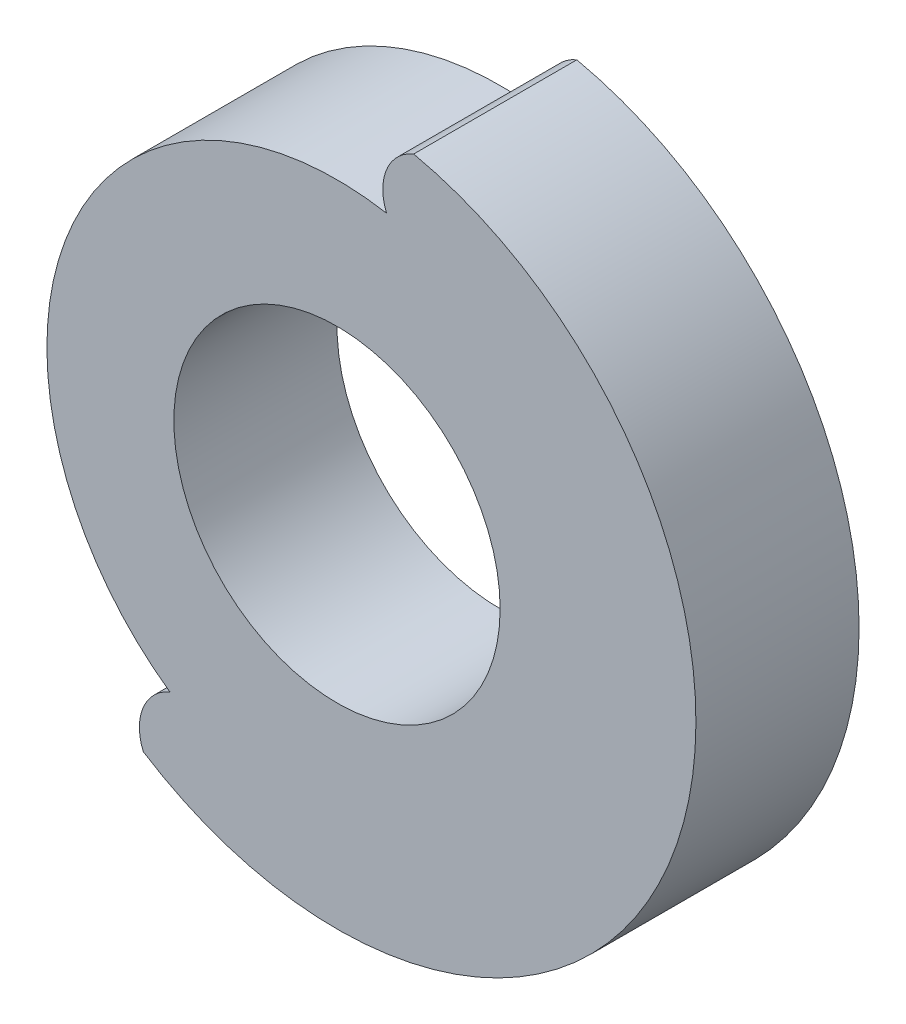
ISO-10303-21;
HEADER;
FILE_DESCRIPTION(('STEP AP214'),'2;1');
FILE_NAME('part.step','',(''),(''),'','','');
FILE_SCHEMA(('AUTOMOTIVE_DESIGN { 1 0 10303 214 1 1 1 1 }'));
ENDSEC;
DATA;
#1=APPLICATION_CONTEXT('core data for automotive mechanical design processes');
#2=APPLICATION_PROTOCOL_DEFINITION('international standard','automotive_design',2000,#1);
#3=PRODUCT_CONTEXT('',#1,'mechanical');
#4=PRODUCT('Part','Part','',(#3));
#5=PRODUCT_RELATED_PRODUCT_CATEGORY('part','',(#4));
#6=PRODUCT_DEFINITION_FORMATION('','',#4);
#7=PRODUCT_DEFINITION_CONTEXT('part definition',#1,'design');
#8=PRODUCT_DEFINITION('design','',#6,#7);
#9=PRODUCT_DEFINITION_SHAPE('','',#8);
#10=(LENGTH_UNIT() NAMED_UNIT(*) SI_UNIT(.MILLI.,.METRE.));
#11=(NAMED_UNIT(*) PLANE_ANGLE_UNIT() SI_UNIT($,.RADIAN.));
#12=(NAMED_UNIT(*) SI_UNIT($,.STERADIAN.) SOLID_ANGLE_UNIT());
#13=UNCERTAINTY_MEASURE_WITH_UNIT(LENGTH_MEASURE(1.E-05),#10,'distance_accuracy_value','');
#14=(GEOMETRIC_REPRESENTATION_CONTEXT(3) GLOBAL_UNCERTAINTY_ASSIGNED_CONTEXT((#13)) GLOBAL_UNIT_ASSIGNED_CONTEXT((#10,
#11,#12)) REPRESENTATION_CONTEXT('',''));
#15=CARTESIAN_POINT('',(0.,0.,0.));
#16=DIRECTION('',(0.,0.,1.));
#17=DIRECTION('',(1.,0.,0.));
#18=AXIS2_PLACEMENT_3D('',#15,#16,#17);
#19=CARTESIAN_POINT('',(0.,0.,6.));
#20=DIRECTION('',(0.,0.,1.));
#21=DIRECTION('',(1.,0.,0.));
#22=AXIS2_PLACEMENT_3D('',#19,#20,#21);
#23=PLANE('',#22);
#24=CARTESIAN_POINT('',(0.,0.,6.));
#25=DIRECTION('',(0.,0.,1.));
#26=DIRECTION('',(1.,0.,0.));
#27=AXIS2_PLACEMENT_3D('',#24,#25,#26);
#28=CIRCLE('',#27,6.);
#29=CARTESIAN_POINT('',(6.,0.,6.));
#30=VERTEX_POINT('',#29);
#31=EDGE_CURVE('E100',#30,#30,#28,.T.);
#32=ORIENTED_EDGE('',*,*,#31,.F.);
#33=EDGE_LOOP('',(#32));
#34=FACE_BOUND('',#33,.T.);
#35=CARTESIAN_POINT('',(0.,0.,6.));
#36=DIRECTION('',(0.,0.,-1.));
#37=DIRECTION('',(-1.,0.,0.));
#38=AXIS2_PLACEMENT_3D('',#35,#36,#37);
#39=CIRCLE('',#38,10.6683645553475);
#40=CARTESIAN_POINT('',(-6.1462773798345,-8.71993558783146,6.));
#41=VERTEX_POINT('',#40);
#42=CARTESIAN_POINT('',(1.81985117133101,10.512,6.));
#43=VERTEX_POINT('',#42);
#44=EDGE_CURVE('E70',#41,#43,#39,.T.);
#45=ORIENTED_EDGE('',*,*,#44,.F.);
#46=CARTESIAN_POINT('',(-5.43917059864794,-10.4051743313833,6.));
#47=DIRECTION('',(0.,0.,-1.));
#48=DIRECTION('',(0.707106781186551,-0.707106781186544,0.));
#49=AXIS2_PLACEMENT_3D('',#46,#47,#48);
#50=CIRCLE('',#49,1.82757479266053);
#51=CARTESIAN_POINT('',(-7.12440934219978,-11.1122811125698,6.));
#52=VERTEX_POINT('',#51);
#53=EDGE_CURVE('E88',#52,#41,#50,.T.);
#54=ORIENTED_EDGE('',*,*,#53,.F.);
#55=CARTESIAN_POINT('',(0.,0.,6.));
#56=DIRECTION('',(0.,0.,1.));
#57=DIRECTION('',(1.,0.,0.));
#58=AXIS2_PLACEMENT_3D('',#55,#56,#57);
#59=CIRCLE('',#58,13.2);
#60=CARTESIAN_POINT('',(2.81985117133101,12.8952874869676,6.));
#61=VERTEX_POINT('',#60);
#62=EDGE_CURVE('E11',#52,#61,#59,.T.);
#63=ORIENTED_EDGE('',*,*,#62,.T.);
#64=CARTESIAN_POINT('',(3.51149491481482,11.2036437434838,6.));
#65=DIRECTION('',(0.,0.,1.));
#66=DIRECTION('',(1.,0.,0.));
#67=AXIS2_PLACEMENT_3D('',#64,#65,#66);
#68=CIRCLE('',#67,1.82757479266053);
#69=EDGE_CURVE('E105',#61,#43,#68,.T.);
#70=ORIENTED_EDGE('',*,*,#69,.T.);
#71=EDGE_LOOP('',(#45,#54,#63,#70));
#72=FACE_BOUND('',#71,.T.);
#73=ADVANCED_FACE('F37',(#34,#72),#23,.T.);
#74=CARTESIAN_POINT('',(0.,0.,0.));
#75=DIRECTION('',(0.,0.,1.));
#76=DIRECTION('',(1.,0.,0.));
#77=AXIS2_PLACEMENT_3D('',#74,#75,#76);
#78=PLANE('',#77);
#79=CARTESIAN_POINT('',(0.,0.,0.));
#80=DIRECTION('',(0.,0.,1.));
#81=DIRECTION('',(1.,0.,0.));
#82=AXIS2_PLACEMENT_3D('',#79,#80,#81);
#83=CIRCLE('',#82,6.);
#84=CARTESIAN_POINT('',(6.,0.,0.));
#85=VERTEX_POINT('',#84);
#86=EDGE_CURVE('E96',#85,#85,#83,.T.);
#87=ORIENTED_EDGE('',*,*,#86,.T.);
#88=EDGE_LOOP('',(#87));
#89=FACE_BOUND('',#88,.T.);
#90=CARTESIAN_POINT('',(-5.43917059864794,-10.4051743313833,0.));
#91=DIRECTION('',(0.,0.,-1.));
#92=DIRECTION('',(0.707106781186551,-0.707106781186544,0.));
#93=AXIS2_PLACEMENT_3D('',#90,#91,#92);
#94=CIRCLE('',#93,1.82757479266053);
#95=CARTESIAN_POINT('',(-7.12440934219978,-11.1122811125698,0.));
#96=VERTEX_POINT('',#95);
#97=CARTESIAN_POINT('',(-6.1462773798345,-8.71993558783146,0.));
#98=VERTEX_POINT('',#97);
#99=EDGE_CURVE('E79',#96,#98,#94,.T.);
#100=ORIENTED_EDGE('',*,*,#99,.T.);
#101=CARTESIAN_POINT('',(0.,0.,0.));
#102=DIRECTION('',(0.,0.,-1.));
#103=DIRECTION('',(-1.,0.,0.));
#104=AXIS2_PLACEMENT_3D('',#101,#102,#103);
#105=CIRCLE('',#104,10.6683645553475);
#106=CARTESIAN_POINT('',(1.81985117133101,10.512,0.));
#107=VERTEX_POINT('',#106);
#108=EDGE_CURVE('E222',#98,#107,#105,.T.);
#109=ORIENTED_EDGE('',*,*,#108,.T.);
#110=CARTESIAN_POINT('',(3.51149491481482,11.2036437434838,0.));
#111=DIRECTION('',(0.,0.,1.));
#112=DIRECTION('',(1.,0.,0.));
#113=AXIS2_PLACEMENT_3D('',#110,#111,#112);
#114=CIRCLE('',#113,1.82757479266053);
#115=CARTESIAN_POINT('',(2.81985117133101,12.8952874869676,0.));
#116=VERTEX_POINT('',#115);
#117=EDGE_CURVE('E102',#116,#107,#114,.T.);
#118=ORIENTED_EDGE('',*,*,#117,.F.);
#119=CARTESIAN_POINT('',(0.,0.,0.));
#120=DIRECTION('',(0.,0.,1.));
#121=DIRECTION('',(1.,0.,0.));
#122=AXIS2_PLACEMENT_3D('',#119,#120,#121);
#123=CIRCLE('',#122,13.2);
#124=EDGE_CURVE('E41',#96,#116,#123,.T.);
#125=ORIENTED_EDGE('',*,*,#124,.F.);
#126=EDGE_LOOP('',(#100,#109,#118,#125));
#127=FACE_BOUND('',#126,.T.);
#128=ADVANCED_FACE('F115',(#89,#127),#78,.F.);
#129=CARTESIAN_POINT('',(0.,0.,6.));
#130=DIRECTION('',(0.,0.,-1.));
#131=DIRECTION('',(-1.,0.,0.));
#132=AXIS2_PLACEMENT_3D('',#129,#130,#131);
#133=CYLINDRICAL_SURFACE('',#132,13.2);
#134=ORIENTED_EDGE('',*,*,#62,.F.);
#135=DIRECTION('',(0.,0.,1.));
#136=VECTOR('',#135,1.);
#137=CARTESIAN_POINT('',(-7.12440934219978,-11.1122811125698,0.));
#138=LINE('',#137,#136);
#139=EDGE_CURVE('E86',#96,#52,#138,.T.);
#140=ORIENTED_EDGE('',*,*,#139,.F.);
#141=ORIENTED_EDGE('',*,*,#124,.T.);
#142=DIRECTION('',(0.,0.,1.));
#143=VECTOR('',#142,1.);
#144=CARTESIAN_POINT('',(2.81985117133101,12.8952874869676,0.));
#145=LINE('',#144,#143);
#146=EDGE_CURVE('E92',#116,#61,#145,.T.);
#147=ORIENTED_EDGE('',*,*,#146,.T.);
#148=EDGE_LOOP('',(#134,#140,#141,#147));
#149=FACE_BOUND('',#148,.T.);
#150=ADVANCED_FACE('F39',(#149),#133,.T.);
#151=CARTESIAN_POINT('',(0.,0.,6.));
#152=DIRECTION('',(0.,0.,-1.));
#153=DIRECTION('',(-1.,0.,0.));
#154=AXIS2_PLACEMENT_3D('',#151,#152,#153);
#155=CYLINDRICAL_SURFACE('',#154,6.);
#156=ORIENTED_EDGE('',*,*,#31,.T.);
#157=EDGE_LOOP('',(#156));
#158=FACE_BOUND('',#157,.T.);
#159=ORIENTED_EDGE('',*,*,#86,.F.);
#160=EDGE_LOOP('',(#159));
#161=FACE_BOUND('',#160,.T.);
#162=ADVANCED_FACE('F111',(#158,#161),#155,.F.);
#163=CARTESIAN_POINT('',(3.51149491481482,11.2036437434838,0.));
#164=DIRECTION('',(0.,0.,1.));
#165=DIRECTION('',(1.,0.,0.));
#166=AXIS2_PLACEMENT_3D('',#163,#164,#165);
#167=CYLINDRICAL_SURFACE('',#166,1.82757479266053);
#168=ORIENTED_EDGE('',*,*,#69,.F.);
#169=ORIENTED_EDGE('',*,*,#146,.F.);
#170=ORIENTED_EDGE('',*,*,#117,.T.);
#171=DIRECTION('',(0.,0.,1.));
#172=VECTOR('',#171,1.);
#173=CARTESIAN_POINT('',(1.81985117133101,10.512,0.));
#174=LINE('',#173,#172);
#175=EDGE_CURVE('E97',#107,#43,#174,.T.);
#176=ORIENTED_EDGE('',*,*,#175,.T.);
#177=EDGE_LOOP('',(#168,#169,#170,#176));
#178=FACE_BOUND('',#177,.T.);
#179=ADVANCED_FACE('F124',(#178),#167,.T.);
#180=CARTESIAN_POINT('',(0.,0.,0.));
#181=DIRECTION('',(0.,0.,1.));
#182=DIRECTION('',(1.,0.,0.));
#183=AXIS2_PLACEMENT_3D('',#180,#181,#182);
#184=CYLINDRICAL_SURFACE('',#183,10.6683645553475);
#185=ORIENTED_EDGE('',*,*,#44,.T.);
#186=ORIENTED_EDGE('',*,*,#175,.F.);
#187=ORIENTED_EDGE('',*,*,#108,.F.);
#188=DIRECTION('',(0.,0.,1.));
#189=VECTOR('',#188,1.);
#190=CARTESIAN_POINT('',(-6.1462773798345,-8.71993558783146,0.));
#191=LINE('',#190,#189);
#192=EDGE_CURVE('E89',#98,#41,#191,.T.);
#193=ORIENTED_EDGE('',*,*,#192,.T.);
#194=EDGE_LOOP('',(#185,#186,#187,#193));
#195=FACE_BOUND('',#194,.T.);
#196=ADVANCED_FACE('F125',(#195),#184,.T.);
#197=CARTESIAN_POINT('',(-5.43917059864794,-10.4051743313833,0.));
#198=DIRECTION('',(0.,0.,1.));
#199=DIRECTION('',(1.,0.,0.));
#200=AXIS2_PLACEMENT_3D('',#197,#198,#199);
#201=CYLINDRICAL_SURFACE('',#200,1.82757479266053);
#202=ORIENTED_EDGE('',*,*,#53,.T.);
#203=ORIENTED_EDGE('',*,*,#192,.F.);
#204=ORIENTED_EDGE('',*,*,#99,.F.);
#205=ORIENTED_EDGE('',*,*,#139,.T.);
#206=EDGE_LOOP('',(#202,#203,#204,#205));
#207=FACE_BOUND('',#206,.T.);
#208=ADVANCED_FACE('F87',(#207),#201,.T.);
#209=CLOSED_SHELL('',(#73,#128,#150,#162,#179,#196,#208));
#210=MANIFOLD_SOLID_BREP('B2',#209);
#211=ADVANCED_BREP_SHAPE_REPRESENTATION('',(#18,#210),#14);
#212=SHAPE_DEFINITION_REPRESENTATION(#9,#211);
ENDSEC;
END-ISO-10303-21;
